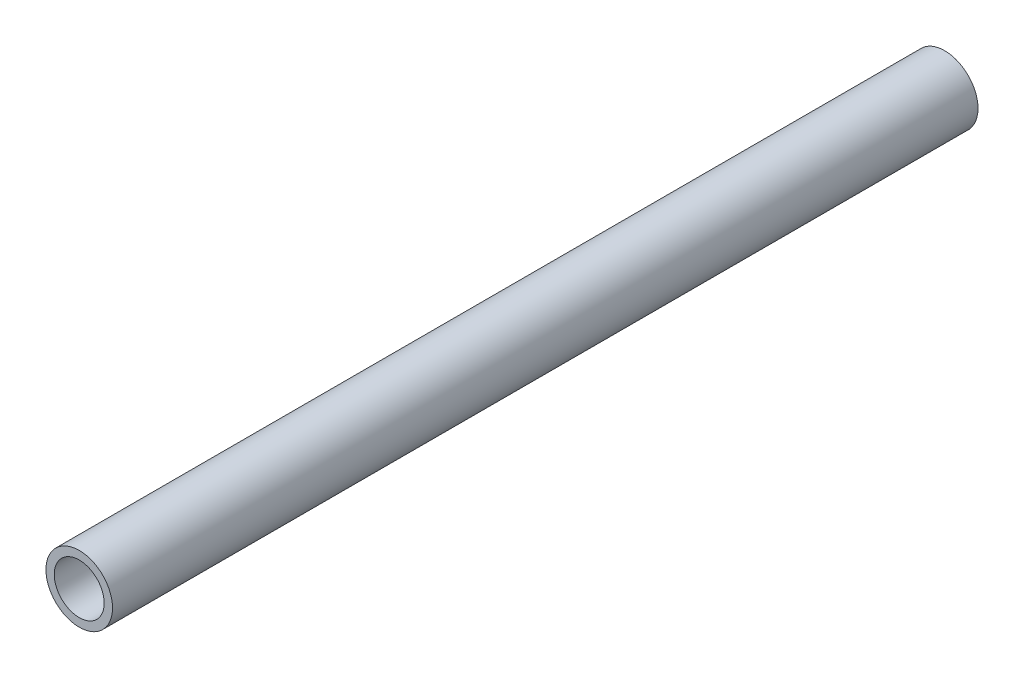
ISO-10303-21;
HEADER;
FILE_DESCRIPTION(('STEP AP214'),'2;1');
FILE_NAME('part.step','',(''),(''),'','','');
FILE_SCHEMA(('AUTOMOTIVE_DESIGN { 1 0 10303 214 1 1 1 1 }'));
ENDSEC;
DATA;
#1=APPLICATION_CONTEXT('core data for automotive mechanical design processes');
#2=APPLICATION_PROTOCOL_DEFINITION('international standard','automotive_design',2000,#1);
#3=PRODUCT_CONTEXT('',#1,'mechanical');
#4=PRODUCT('Part','Part','',(#3));
#5=PRODUCT_RELATED_PRODUCT_CATEGORY('part','',(#4));
#6=PRODUCT_DEFINITION_FORMATION('','',#4);
#7=PRODUCT_DEFINITION_CONTEXT('part definition',#1,'design');
#8=PRODUCT_DEFINITION('design','',#6,#7);
#9=PRODUCT_DEFINITION_SHAPE('','',#8);
#10=(LENGTH_UNIT() NAMED_UNIT(*) SI_UNIT(.MILLI.,.METRE.));
#11=(NAMED_UNIT(*) PLANE_ANGLE_UNIT() SI_UNIT($,.RADIAN.));
#12=(NAMED_UNIT(*) SI_UNIT($,.STERADIAN.) SOLID_ANGLE_UNIT());
#13=UNCERTAINTY_MEASURE_WITH_UNIT(LENGTH_MEASURE(1.E-05),#10,'distance_accuracy_value','');
#14=(GEOMETRIC_REPRESENTATION_CONTEXT(3) GLOBAL_UNCERTAINTY_ASSIGNED_CONTEXT((#13)) GLOBAL_UNIT_ASSIGNED_CONTEXT((#10,
#11,#12)) REPRESENTATION_CONTEXT('',''));
#15=CARTESIAN_POINT('',(0.,0.,0.));
#16=DIRECTION('',(0.,0.,1.));
#17=DIRECTION('',(1.,0.,0.));
#18=AXIS2_PLACEMENT_3D('',#15,#16,#17);
#19=CARTESIAN_POINT('',(0.,0.,1040.));
#20=DIRECTION('',(0.,0.,1.));
#21=DIRECTION('',(1.,0.,0.));
#22=AXIS2_PLACEMENT_3D('',#19,#20,#21);
#23=PLANE('',#22);
#24=CARTESIAN_POINT('',(0.,0.,1040.));
#25=DIRECTION('',(0.,0.,1.));
#26=DIRECTION('',(1.,0.,0.));
#27=AXIS2_PLACEMENT_3D('',#24,#25,#26);
#28=CIRCLE('',#27,40.);
#29=CARTESIAN_POINT('',(40.,0.,1040.));
#30=VERTEX_POINT('',#29);
#31=EDGE_CURVE('E10',#30,#30,#28,.T.);
#32=ORIENTED_EDGE('',*,*,#31,.T.);
#33=EDGE_LOOP('',(#32));
#34=FACE_BOUND('',#33,.T.);
#35=CARTESIAN_POINT('',(0.,0.,1040.));
#36=DIRECTION('',(0.,0.,1.));
#37=DIRECTION('',(1.,0.,0.));
#38=AXIS2_PLACEMENT_3D('',#35,#36,#37);
#39=CIRCLE('',#38,30.);
#40=CARTESIAN_POINT('',(30.,0.,1040.));
#41=VERTEX_POINT('',#40);
#42=EDGE_CURVE('E56',#41,#41,#39,.T.);
#43=ORIENTED_EDGE('',*,*,#42,.F.);
#44=EDGE_LOOP('',(#43));
#45=FACE_BOUND('',#44,.T.);
#46=ADVANCED_FACE('F43',(#34,#45),#23,.T.);
#47=CARTESIAN_POINT('',(0.,0.,0.));
#48=DIRECTION('',(0.,0.,1.));
#49=DIRECTION('',(1.,0.,0.));
#50=AXIS2_PLACEMENT_3D('',#47,#48,#49);
#51=PLANE('',#50);
#52=CARTESIAN_POINT('',(0.,0.,0.));
#53=DIRECTION('',(0.,0.,1.));
#54=DIRECTION('',(1.,0.,0.));
#55=AXIS2_PLACEMENT_3D('',#52,#53,#54);
#56=CIRCLE('',#55,40.);
#57=CARTESIAN_POINT('',(40.,0.,0.));
#58=VERTEX_POINT('',#57);
#59=EDGE_CURVE('E47',#58,#58,#56,.T.);
#60=ORIENTED_EDGE('',*,*,#59,.F.);
#61=EDGE_LOOP('',(#60));
#62=FACE_BOUND('',#61,.T.);
#63=CARTESIAN_POINT('',(0.,0.,0.));
#64=DIRECTION('',(0.,0.,1.));
#65=DIRECTION('',(1.,0.,0.));
#66=AXIS2_PLACEMENT_3D('',#63,#64,#65);
#67=CIRCLE('',#66,30.);
#68=CARTESIAN_POINT('',(30.,0.,0.));
#69=VERTEX_POINT('',#68);
#70=EDGE_CURVE('E58',#69,#69,#67,.T.);
#71=ORIENTED_EDGE('',*,*,#70,.T.);
#72=EDGE_LOOP('',(#71));
#73=FACE_BOUND('',#72,.T.);
#74=ADVANCED_FACE('F70',(#62,#73),#51,.F.);
#75=CARTESIAN_POINT('',(0.,0.,1040.));
#76=DIRECTION('',(0.,0.,-1.));
#77=DIRECTION('',(-1.,0.,0.));
#78=AXIS2_PLACEMENT_3D('',#75,#76,#77);
#79=CYLINDRICAL_SURFACE('',#78,40.);
#80=ORIENTED_EDGE('',*,*,#31,.F.);
#81=EDGE_LOOP('',(#80));
#82=FACE_BOUND('',#81,.T.);
#83=ORIENTED_EDGE('',*,*,#59,.T.);
#84=EDGE_LOOP('',(#83));
#85=FACE_BOUND('',#84,.T.);
#86=ADVANCED_FACE('F45',(#82,#85),#79,.T.);
#87=CARTESIAN_POINT('',(0.,0.,1040.));
#88=DIRECTION('',(0.,0.,-1.));
#89=DIRECTION('',(-1.,0.,0.));
#90=AXIS2_PLACEMENT_3D('',#87,#88,#89);
#91=CYLINDRICAL_SURFACE('',#90,30.);
#92=ORIENTED_EDGE('',*,*,#42,.T.);
#93=EDGE_LOOP('',(#92));
#94=FACE_BOUND('',#93,.T.);
#95=ORIENTED_EDGE('',*,*,#70,.F.);
#96=EDGE_LOOP('',(#95));
#97=FACE_BOUND('',#96,.T.);
#98=ADVANCED_FACE('F66',(#94,#97),#91,.F.);
#99=CLOSED_SHELL('',(#46,#74,#86,#98));
#100=MANIFOLD_SOLID_BREP('B2',#99);
#101=ADVANCED_BREP_SHAPE_REPRESENTATION('',(#18,#100),#14);
#102=SHAPE_DEFINITION_REPRESENTATION(#9,#101);
ENDSEC;
END-ISO-10303-21;
